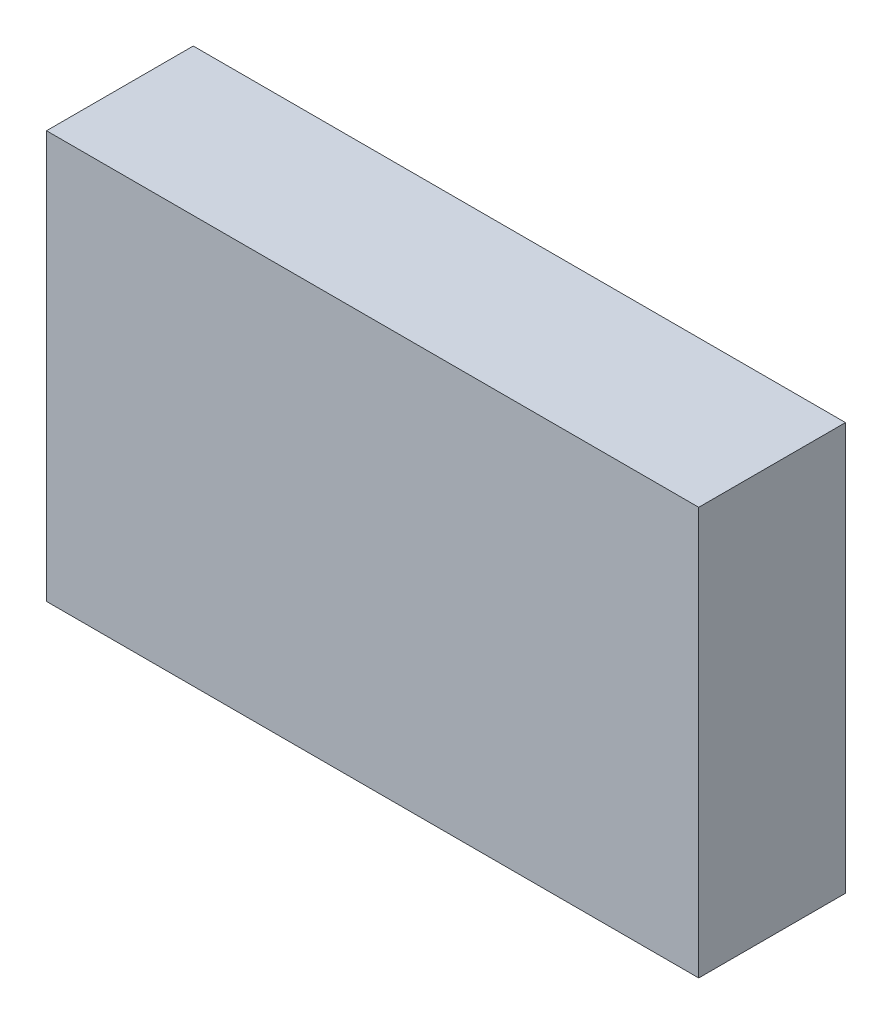
ISO-10303-21;
HEADER;
FILE_DESCRIPTION(('STEP AP214'),'2;1');
FILE_NAME('part.step','',(''),(''),'','','');
FILE_SCHEMA(('AUTOMOTIVE_DESIGN { 1 0 10303 214 1 1 1 1 }'));
ENDSEC;
DATA;
#1=APPLICATION_CONTEXT('core data for automotive mechanical design processes');
#2=APPLICATION_PROTOCOL_DEFINITION('international standard','automotive_design',2000,#1);
#3=PRODUCT_CONTEXT('',#1,'mechanical');
#4=PRODUCT('Part','Part','',(#3));
#5=PRODUCT_RELATED_PRODUCT_CATEGORY('part','',(#4));
#6=PRODUCT_DEFINITION_FORMATION('','',#4);
#7=PRODUCT_DEFINITION_CONTEXT('part definition',#1,'design');
#8=PRODUCT_DEFINITION('design','',#6,#7);
#9=PRODUCT_DEFINITION_SHAPE('','',#8);
#10=(LENGTH_UNIT() NAMED_UNIT(*) SI_UNIT(.MILLI.,.METRE.));
#11=(NAMED_UNIT(*) PLANE_ANGLE_UNIT() SI_UNIT($,.RADIAN.));
#12=(NAMED_UNIT(*) SI_UNIT($,.STERADIAN.) SOLID_ANGLE_UNIT());
#13=UNCERTAINTY_MEASURE_WITH_UNIT(LENGTH_MEASURE(1.E-05),#10,'distance_accuracy_value','');
#14=(GEOMETRIC_REPRESENTATION_CONTEXT(3) GLOBAL_UNCERTAINTY_ASSIGNED_CONTEXT((#13)) GLOBAL_UNIT_ASSIGNED_CONTEXT((#10,
#11,#12)) REPRESENTATION_CONTEXT('',''));
#15=CARTESIAN_POINT('',(0.,0.,0.));
#16=DIRECTION('',(0.,0.,1.));
#17=DIRECTION('',(1.,0.,0.));
#18=AXIS2_PLACEMENT_3D('',#15,#16,#17);
#19=CARTESIAN_POINT('',(0.99999038,-0.62499748,0.4499991));
#20=DIRECTION('',(0.,0.,1.));
#21=DIRECTION('',(1.,0.,0.));
#22=AXIS2_PLACEMENT_3D('',#19,#20,#21);
#23=PLANE('',#22);
#24=DIRECTION('',(0.,1.,0.));
#25=VECTOR('',#24,1.);
#26=CARTESIAN_POINT('',(-0.99999546,-0.62499748,0.4499991));
#27=LINE('',#26,#25);
#28=CARTESIAN_POINT('',(-0.99999546,-0.62499748,0.4499991));
#29=VERTEX_POINT('',#28);
#30=CARTESIAN_POINT('',(-0.99999546,0.62500002,0.4499991));
#31=VERTEX_POINT('',#30);
#32=EDGE_CURVE('E72',#29,#31,#27,.T.);
#33=ORIENTED_EDGE('',*,*,#32,.F.);
#34=DIRECTION('',(1.,0.,0.));
#35=VECTOR('',#34,1.);
#36=CARTESIAN_POINT('',(0.99999038,-0.62499748,0.4499991));
#37=LINE('',#36,#35);
#38=CARTESIAN_POINT('',(0.999990380000005,-0.62499748,0.4499991));
#39=VERTEX_POINT('',#38);
#40=EDGE_CURVE('E65',#39,#29,#37,.F.);
#41=ORIENTED_EDGE('',*,*,#40,.F.);
#42=DIRECTION('',(6.09601218471156E-06,0.999999999981419,0.));
#43=VECTOR('',#42,1.);
#44=CARTESIAN_POINT('',(0.999998,0.62500002,0.4499991));
#45=LINE('',#44,#43);
#46=CARTESIAN_POINT('',(0.999998,0.62500002,0.4499991));
#47=VERTEX_POINT('',#46);
#48=EDGE_CURVE('E19',#47,#39,#45,.F.);
#49=ORIENTED_EDGE('',*,*,#48,.F.);
#50=DIRECTION('',(1.,0.,0.));
#51=VECTOR('',#50,1.);
#52=CARTESIAN_POINT('',(-0.99999546,0.62500002,0.4499991));
#53=LINE('',#52,#51);
#54=EDGE_CURVE('E53',#31,#47,#53,.T.);
#55=ORIENTED_EDGE('',*,*,#54,.F.);
#56=EDGE_LOOP('',(#33,#41,#49,#55));
#57=FACE_BOUND('',#56,.T.);
#58=ADVANCED_FACE('F16',(#57),#23,.T.);
#59=CARTESIAN_POINT('',(0.999998,0.62500002,0.));
#60=DIRECTION('',(0.999999999981419,-6.09601218471156E-06,0.));
#61=DIRECTION('',(6.09601218471156E-06,0.999999999981419,0.));
#62=AXIS2_PLACEMENT_3D('',#59,#60,#61);
#63=PLANE('',#62);
#64=DIRECTION('',(0.,0.,-1.));
#65=VECTOR('',#64,1.);
#66=CARTESIAN_POINT('',(0.99999038,-0.62499748,0.));
#67=LINE('',#66,#65);
#68=CARTESIAN_POINT('',(0.999990380000005,-0.62499748,0.));
#69=VERTEX_POINT('',#68);
#70=EDGE_CURVE('E78',#69,#39,#67,.F.);
#71=ORIENTED_EDGE('',*,*,#70,.F.);
#72=DIRECTION('',(6.09601218471156E-06,0.999999999981419,0.));
#73=VECTOR('',#72,1.);
#74=CARTESIAN_POINT('',(0.999998,0.62500002,0.));
#75=LINE('',#74,#73);
#76=CARTESIAN_POINT('',(0.999998,0.62500002,0.));
#77=VERTEX_POINT('',#76);
#78=EDGE_CURVE('E71',#69,#77,#75,.T.);
#79=ORIENTED_EDGE('',*,*,#78,.T.);
#80=DIRECTION('',(0.,0.,1.));
#81=VECTOR('',#80,1.);
#82=CARTESIAN_POINT('',(0.999998,0.62500002,0.));
#83=LINE('',#82,#81);
#84=EDGE_CURVE('E58',#47,#77,#83,.F.);
#85=ORIENTED_EDGE('',*,*,#84,.F.);
#86=ORIENTED_EDGE('',*,*,#48,.T.);
#87=EDGE_LOOP('',(#71,#79,#85,#86));
#88=FACE_BOUND('',#87,.T.);
#89=ADVANCED_FACE('F70',(#88),#63,.T.);
#90=CARTESIAN_POINT('',(-0.99999546,0.62500002,0.));
#91=DIRECTION('',(0.,1.,0.));
#92=DIRECTION('',(0.,0.,1.));
#93=AXIS2_PLACEMENT_3D('',#90,#91,#92);
#94=PLANE('',#93);
#95=ORIENTED_EDGE('',*,*,#84,.T.);
#96=DIRECTION('',(1.,0.,0.));
#97=VECTOR('',#96,1.);
#98=CARTESIAN_POINT('',(-0.99999546,0.62500002,0.));
#99=LINE('',#98,#97);
#100=CARTESIAN_POINT('',(-0.99999546,0.62500002,0.));
#101=VERTEX_POINT('',#100);
#102=EDGE_CURVE('E88',#77,#101,#99,.F.);
#103=ORIENTED_EDGE('',*,*,#102,.T.);
#104=DIRECTION('',(0.,0.,1.));
#105=VECTOR('',#104,1.);
#106=CARTESIAN_POINT('',(-0.99999546,0.62500002,0.));
#107=LINE('',#106,#105);
#108=EDGE_CURVE('E60',#31,#101,#107,.F.);
#109=ORIENTED_EDGE('',*,*,#108,.F.);
#110=ORIENTED_EDGE('',*,*,#54,.T.);
#111=EDGE_LOOP('',(#95,#103,#109,#110));
#112=FACE_BOUND('',#111,.T.);
#113=ADVANCED_FACE('F55',(#112),#94,.T.);
#114=CARTESIAN_POINT('',(-0.99999546,-0.62499748,0.));
#115=DIRECTION('',(-1.,0.,0.));
#116=DIRECTION('',(0.,0.,1.));
#117=AXIS2_PLACEMENT_3D('',#114,#115,#116);
#118=PLANE('',#117);
#119=ORIENTED_EDGE('',*,*,#108,.T.);
#120=DIRECTION('',(0.,1.,0.));
#121=VECTOR('',#120,1.);
#122=CARTESIAN_POINT('',(-0.99999546,-0.62499748,0.));
#123=LINE('',#122,#121);
#124=CARTESIAN_POINT('',(-0.99999546,-0.62499748,0.));
#125=VERTEX_POINT('',#124);
#126=EDGE_CURVE('E25',#101,#125,#123,.F.);
#127=ORIENTED_EDGE('',*,*,#126,.T.);
#128=DIRECTION('',(0.,0.,-1.));
#129=VECTOR('',#128,1.);
#130=CARTESIAN_POINT('',(-0.99999546,-0.62499748,0.));
#131=LINE('',#130,#129);
#132=EDGE_CURVE('E33',#29,#125,#131,.T.);
#133=ORIENTED_EDGE('',*,*,#132,.F.);
#134=ORIENTED_EDGE('',*,*,#32,.T.);
#135=EDGE_LOOP('',(#119,#127,#133,#134));
#136=FACE_BOUND('',#135,.T.);
#137=ADVANCED_FACE('F93',(#136),#118,.T.);
#138=CARTESIAN_POINT('',(0.99999038,-0.62499748,0.));
#139=DIRECTION('',(0.,-1.,0.));
#140=DIRECTION('',(0.,0.,-1.));
#141=AXIS2_PLACEMENT_3D('',#138,#139,#140);
#142=PLANE('',#141);
#143=ORIENTED_EDGE('',*,*,#132,.T.);
#144=DIRECTION('',(1.,0.,0.));
#145=VECTOR('',#144,1.);
#146=CARTESIAN_POINT('',(0.99999038,-0.62499748,0.));
#147=LINE('',#146,#145);
#148=EDGE_CURVE('E11',#125,#69,#147,.T.);
#149=ORIENTED_EDGE('',*,*,#148,.T.);
#150=ORIENTED_EDGE('',*,*,#70,.T.);
#151=ORIENTED_EDGE('',*,*,#40,.T.);
#152=EDGE_LOOP('',(#143,#149,#150,#151));
#153=FACE_BOUND('',#152,.T.);
#154=ADVANCED_FACE('F96',(#153),#142,.T.);
#155=CARTESIAN_POINT('',(0.99999038,-0.62499748,0.));
#156=DIRECTION('',(0.,0.,1.));
#157=DIRECTION('',(1.,0.,0.));
#158=AXIS2_PLACEMENT_3D('',#155,#156,#157);
#159=PLANE('',#158);
#160=ORIENTED_EDGE('',*,*,#126,.F.);
#161=ORIENTED_EDGE('',*,*,#102,.F.);
#162=ORIENTED_EDGE('',*,*,#78,.F.);
#163=ORIENTED_EDGE('',*,*,#148,.F.);
#164=EDGE_LOOP('',(#160,#161,#162,#163));
#165=FACE_BOUND('',#164,.T.);
#166=ADVANCED_FACE('F95',(#165),#159,.F.);
#167=CLOSED_SHELL('',(#58,#89,#113,#137,#154,#166));
#168=MANIFOLD_SOLID_BREP('B1',#167);
#169=ADVANCED_BREP_SHAPE_REPRESENTATION('',(#18,#168),#14);
#170=SHAPE_DEFINITION_REPRESENTATION(#9,#169);
ENDSEC;
END-ISO-10303-21;
